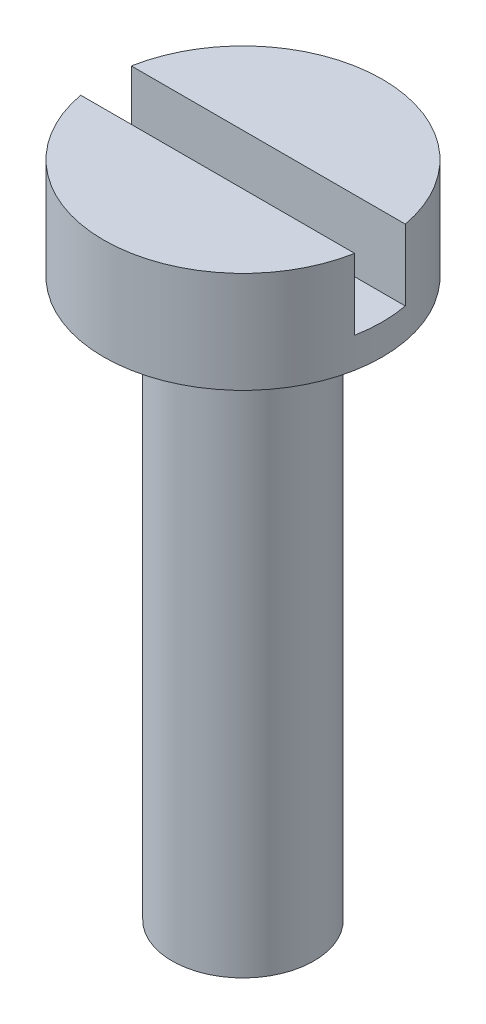
ISO-10303-21;
HEADER;
FILE_DESCRIPTION(('STEP AP214'),'2;1');
FILE_NAME('part.step','',(''),(''),'','','');
FILE_SCHEMA(('AUTOMOTIVE_DESIGN { 1 0 10303 214 1 1 1 1 }'));
ENDSEC;
DATA;
#1=APPLICATION_CONTEXT('core data for automotive mechanical design processes');
#2=APPLICATION_PROTOCOL_DEFINITION('international standard','automotive_design',2000,#1);
#3=PRODUCT_CONTEXT('',#1,'mechanical');
#4=PRODUCT('Part','Part','',(#3));
#5=PRODUCT_RELATED_PRODUCT_CATEGORY('part','',(#4));
#6=PRODUCT_DEFINITION_FORMATION('','',#4);
#7=PRODUCT_DEFINITION_CONTEXT('part definition',#1,'design');
#8=PRODUCT_DEFINITION('design','',#6,#7);
#9=PRODUCT_DEFINITION_SHAPE('','',#8);
#10=(LENGTH_UNIT() NAMED_UNIT(*) SI_UNIT(.MILLI.,.METRE.));
#11=(NAMED_UNIT(*) PLANE_ANGLE_UNIT() SI_UNIT($,.RADIAN.));
#12=(NAMED_UNIT(*) SI_UNIT($,.STERADIAN.) SOLID_ANGLE_UNIT());
#13=UNCERTAINTY_MEASURE_WITH_UNIT(LENGTH_MEASURE(1.E-05),#10,'distance_accuracy_value','');
#14=(GEOMETRIC_REPRESENTATION_CONTEXT(3) GLOBAL_UNCERTAINTY_ASSIGNED_CONTEXT((#13)) GLOBAL_UNIT_ASSIGNED_CONTEXT((#10,
#11,#12)) REPRESENTATION_CONTEXT('',''));
#15=CARTESIAN_POINT('',(0.,0.,0.));
#16=DIRECTION('',(0.,0.,1.));
#17=DIRECTION('',(1.,0.,0.));
#18=AXIS2_PLACEMENT_3D('',#15,#16,#17);
#19=CARTESIAN_POINT('',(0.,2.,0.));
#20=DIRECTION('',(0.,1.,0.));
#21=DIRECTION('',(0.,0.,1.));
#22=AXIS2_PLACEMENT_3D('',#19,#20,#21);
#23=PLANE('',#22);
#24=DIRECTION('',(1.,0.,0.));
#25=VECTOR('',#24,1.);
#26=CARTESIAN_POINT('',(0.,2.,0.5));
#27=LINE('',#26,#25);
#28=CARTESIAN_POINT('',(-2.70416345659799,2.,0.5));
#29=VERTEX_POINT('',#28);
#30=CARTESIAN_POINT('',(2.70416345659799,2.,0.5));
#31=VERTEX_POINT('',#30);
#32=EDGE_CURVE('E63',#29,#31,#27,.T.);
#33=ORIENTED_EDGE('',*,*,#32,.F.);
#34=CARTESIAN_POINT('',(0.,2.,0.));
#35=DIRECTION('',(0.,1.,0.));
#36=DIRECTION('',(0.,0.,1.));
#37=AXIS2_PLACEMENT_3D('',#34,#35,#36);
#38=CIRCLE('',#37,2.75);
#39=EDGE_CURVE('E99',#29,#31,#38,.T.);
#40=ORIENTED_EDGE('',*,*,#39,.T.);
#41=EDGE_LOOP('',(#33,#40));
#42=FACE_BOUND('',#41,.T.);
#43=ADVANCED_FACE('F39',(#42),#23,.T.);
#44=CARTESIAN_POINT('',(0.,2.,0.));
#45=DIRECTION('',(0.,-1.,0.));
#46=DIRECTION('',(0.,0.,-1.));
#47=AXIS2_PLACEMENT_3D('',#44,#45,#46);
#48=CYLINDRICAL_SURFACE('',#47,2.75);
#49=CARTESIAN_POINT('',(2.70416345659799,2.,-0.5));
#50=VERTEX_POINT('',#49);
#51=CARTESIAN_POINT('',(-2.70416345659799,2.,-0.5));
#52=VERTEX_POINT('',#51);
#53=EDGE_CURVE('E92',#50,#52,#38,.T.);
#54=ORIENTED_EDGE('',*,*,#53,.F.);
#55=DIRECTION('',(0.,-1.,0.));
#56=VECTOR('',#55,1.);
#57=CARTESIAN_POINT('',(2.70416345659799,2.,-0.5));
#58=LINE('',#57,#56);
#59=CARTESIAN_POINT('',(2.70416345659799,0.6,-0.5));
#60=VERTEX_POINT('',#59);
#61=EDGE_CURVE('E55',#50,#60,#58,.T.);
#62=ORIENTED_EDGE('',*,*,#61,.T.);
#63=CARTESIAN_POINT('',(0.,0.6,0.));
#64=DIRECTION('',(0.,-1.,0.));
#65=DIRECTION('',(0.,0.,-1.));
#66=AXIS2_PLACEMENT_3D('',#63,#64,#65);
#67=CIRCLE('',#66,2.75);
#68=CARTESIAN_POINT('',(2.70416345659799,0.6,0.5));
#69=VERTEX_POINT('',#68);
#70=EDGE_CURVE('E43',#60,#69,#67,.T.);
#71=ORIENTED_EDGE('',*,*,#70,.T.);
#72=DIRECTION('',(0.,-1.,0.));
#73=VECTOR('',#72,1.);
#74=CARTESIAN_POINT('',(2.70416345659799,2.,0.5));
#75=LINE('',#74,#73);
#76=EDGE_CURVE('E116',#69,#31,#75,.F.);
#77=ORIENTED_EDGE('',*,*,#76,.T.);
#78=ORIENTED_EDGE('',*,*,#39,.F.);
#79=DIRECTION('',(0.,-1.,0.));
#80=VECTOR('',#79,1.);
#81=CARTESIAN_POINT('',(-2.70416345659799,2.,0.5));
#82=LINE('',#81,#80);
#83=CARTESIAN_POINT('',(-2.70416345659799,0.6,0.5));
#84=VERTEX_POINT('',#83);
#85=EDGE_CURVE('E131',#29,#84,#82,.T.);
#86=ORIENTED_EDGE('',*,*,#85,.T.);
#87=CARTESIAN_POINT('',(-2.70416345659799,0.6,-0.5));
#88=VERTEX_POINT('',#87);
#89=EDGE_CURVE('E11',#84,#88,#67,.T.);
#90=ORIENTED_EDGE('',*,*,#89,.T.);
#91=DIRECTION('',(0.,-1.,0.));
#92=VECTOR('',#91,1.);
#93=CARTESIAN_POINT('',(-2.70416345659799,2.,-0.5));
#94=LINE('',#93,#92);
#95=EDGE_CURVE('E82',#88,#52,#94,.F.);
#96=ORIENTED_EDGE('',*,*,#95,.T.);
#97=EDGE_LOOP('',(#54,#62,#71,#77,#78,#86,#90,#96));
#98=FACE_BOUND('',#97,.T.);
#99=CARTESIAN_POINT('',(0.,0.,0.));
#100=DIRECTION('',(0.,1.,0.));
#101=DIRECTION('',(0.,0.,1.));
#102=AXIS2_PLACEMENT_3D('',#99,#100,#101);
#103=CIRCLE('',#102,2.75);
#104=CARTESIAN_POINT('',(0.,0.,2.75));
#105=VERTEX_POINT('',#104);
#106=EDGE_CURVE('E106',#105,#105,#103,.T.);
#107=ORIENTED_EDGE('',*,*,#106,.T.);
#108=EDGE_LOOP('',(#107));
#109=FACE_BOUND('',#108,.T.);
#110=ADVANCED_FACE('F41',(#98,#109),#48,.T.);
#111=DIRECTION('',(-1.,0.,0.));
#112=VECTOR('',#111,1.);
#113=CARTESIAN_POINT('',(0.,2.,-0.5));
#114=LINE('',#113,#112);
#115=EDGE_CURVE('E79',#50,#52,#114,.T.);
#116=ORIENTED_EDGE('',*,*,#115,.F.);
#117=ORIENTED_EDGE('',*,*,#53,.T.);
#118=EDGE_LOOP('',(#116,#117));
#119=FACE_BOUND('',#118,.T.);
#120=ADVANCED_FACE('F97',(#119),#23,.T.);
#121=CARTESIAN_POINT('',(0.,0.,0.));
#122=DIRECTION('',(0.,1.,0.));
#123=DIRECTION('',(0.,0.,1.));
#124=AXIS2_PLACEMENT_3D('',#121,#122,#123);
#125=PLANE('',#124);
#126=CARTESIAN_POINT('',(0.,0.,0.));
#127=DIRECTION('',(0.,-1.,0.));
#128=DIRECTION('',(0.,0.,-1.));
#129=AXIS2_PLACEMENT_3D('',#126,#127,#128);
#130=CIRCLE('',#129,1.4);
#131=CARTESIAN_POINT('',(0.,0.,-1.4));
#132=VERTEX_POINT('',#131);
#133=EDGE_CURVE('E88',#132,#132,#130,.T.);
#134=ORIENTED_EDGE('',*,*,#133,.F.);
#135=EDGE_LOOP('',(#134));
#136=FACE_BOUND('',#135,.T.);
#137=ORIENTED_EDGE('',*,*,#106,.F.);
#138=EDGE_LOOP('',(#137));
#139=FACE_BOUND('',#138,.T.);
#140=ADVANCED_FACE('F142',(#136,#139),#125,.F.);
#141=CARTESIAN_POINT('',(0.,-11.,0.));
#142=DIRECTION('',(0.,1.,0.));
#143=DIRECTION('',(0.,0.,1.));
#144=AXIS2_PLACEMENT_3D('',#141,#142,#143);
#145=CYLINDRICAL_SURFACE('',#144,1.4);
#146=CARTESIAN_POINT('',(0.,-11.,0.));
#147=DIRECTION('',(0.,-1.,0.));
#148=DIRECTION('',(0.,0.,-1.));
#149=AXIS2_PLACEMENT_3D('',#146,#147,#148);
#150=CIRCLE('',#149,1.4);
#151=CARTESIAN_POINT('',(0.,-11.,-1.4));
#152=VERTEX_POINT('',#151);
#153=EDGE_CURVE('E111',#152,#152,#150,.T.);
#154=ORIENTED_EDGE('',*,*,#153,.F.);
#155=EDGE_LOOP('',(#154));
#156=FACE_BOUND('',#155,.T.);
#157=ORIENTED_EDGE('',*,*,#133,.T.);
#158=EDGE_LOOP('',(#157));
#159=FACE_BOUND('',#158,.T.);
#160=ADVANCED_FACE('F139',(#156,#159),#145,.T.);
#161=CARTESIAN_POINT('',(0.,-11.,0.));
#162=DIRECTION('',(0.,-1.,0.));
#163=DIRECTION('',(0.,0.,-1.));
#164=AXIS2_PLACEMENT_3D('',#161,#162,#163);
#165=PLANE('',#164);
#166=ORIENTED_EDGE('',*,*,#153,.T.);
#167=EDGE_LOOP('',(#166));
#168=FACE_BOUND('',#167,.T.);
#169=ADVANCED_FACE('F137',(#168),#165,.T.);
#170=CARTESIAN_POINT('',(-2.75,0.6,-0.5));
#171=DIRECTION('',(0.,-1.,0.));
#172=DIRECTION('',(0.,0.,-1.));
#173=AXIS2_PLACEMENT_3D('',#170,#171,#172);
#174=PLANE('',#173);
#175=DIRECTION('',(1.,0.,0.));
#176=VECTOR('',#175,1.);
#177=CARTESIAN_POINT('',(-2.75,0.6,-0.5));
#178=LINE('',#177,#176);
#179=EDGE_CURVE('E95',#88,#60,#178,.T.);
#180=ORIENTED_EDGE('',*,*,#179,.F.);
#181=ORIENTED_EDGE('',*,*,#89,.F.);
#182=DIRECTION('',(1.,0.,0.));
#183=VECTOR('',#182,1.);
#184=CARTESIAN_POINT('',(-2.75,0.6,0.5));
#185=LINE('',#184,#183);
#186=EDGE_CURVE('E121',#84,#69,#185,.T.);
#187=ORIENTED_EDGE('',*,*,#186,.T.);
#188=ORIENTED_EDGE('',*,*,#70,.F.);
#189=EDGE_LOOP('',(#180,#181,#187,#188));
#190=FACE_BOUND('',#189,.T.);
#191=ADVANCED_FACE('F119',(#190),#174,.F.);
#192=CARTESIAN_POINT('',(-2.75,2.,0.5));
#193=DIRECTION('',(0.,0.,1.));
#194=DIRECTION('',(0.,-1.,0.));
#195=AXIS2_PLACEMENT_3D('',#192,#193,#194);
#196=PLANE('',#195);
#197=ORIENTED_EDGE('',*,*,#32,.T.);
#198=ORIENTED_EDGE('',*,*,#76,.F.);
#199=ORIENTED_EDGE('',*,*,#186,.F.);
#200=ORIENTED_EDGE('',*,*,#85,.F.);
#201=EDGE_LOOP('',(#197,#198,#199,#200));
#202=FACE_BOUND('',#201,.T.);
#203=ADVANCED_FACE('F161',(#202),#196,.F.);
#204=CARTESIAN_POINT('',(-2.75,2.,-0.5));
#205=DIRECTION('',(0.,0.,-1.));
#206=DIRECTION('',(0.,1.,0.));
#207=AXIS2_PLACEMENT_3D('',#204,#205,#206);
#208=PLANE('',#207);
#209=ORIENTED_EDGE('',*,*,#115,.T.);
#210=ORIENTED_EDGE('',*,*,#95,.F.);
#211=ORIENTED_EDGE('',*,*,#179,.T.);
#212=ORIENTED_EDGE('',*,*,#61,.F.);
#213=EDGE_LOOP('',(#209,#210,#211,#212));
#214=FACE_BOUND('',#213,.T.);
#215=ADVANCED_FACE('F81',(#214),#208,.F.);
#216=CLOSED_SHELL('',(#43,#110,#120,#140,#160,#169,#191,#203,#215));
#217=MANIFOLD_SOLID_BREP('B2',#216);
#218=ADVANCED_BREP_SHAPE_REPRESENTATION('',(#18,#217),#14);
#219=SHAPE_DEFINITION_REPRESENTATION(#9,#218);
ENDSEC;
END-ISO-10303-21;
